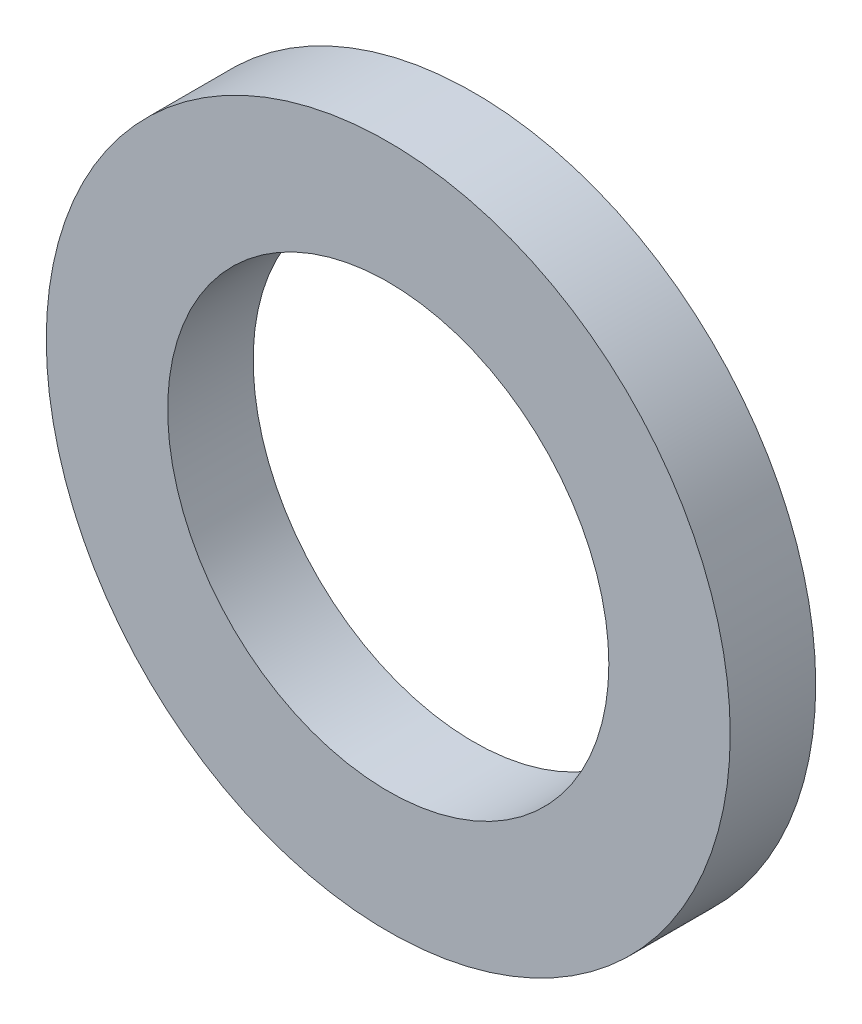
ISO-10303-21;
HEADER;
FILE_DESCRIPTION(('STEP AP214'),'2;1');
FILE_NAME('part.step','',(''),(''),'','','');
FILE_SCHEMA(('AUTOMOTIVE_DESIGN { 1 0 10303 214 1 1 1 1 }'));
ENDSEC;
DATA;
#1=APPLICATION_CONTEXT('core data for automotive mechanical design processes');
#2=APPLICATION_PROTOCOL_DEFINITION('international standard','automotive_design',2000,#1);
#3=PRODUCT_CONTEXT('',#1,'mechanical');
#4=PRODUCT('Part','Part','',(#3));
#5=PRODUCT_RELATED_PRODUCT_CATEGORY('part','',(#4));
#6=PRODUCT_DEFINITION_FORMATION('','',#4);
#7=PRODUCT_DEFINITION_CONTEXT('part definition',#1,'design');
#8=PRODUCT_DEFINITION('design','',#6,#7);
#9=PRODUCT_DEFINITION_SHAPE('','',#8);
#10=(LENGTH_UNIT() NAMED_UNIT(*) SI_UNIT(.MILLI.,.METRE.));
#11=(NAMED_UNIT(*) PLANE_ANGLE_UNIT() SI_UNIT($,.RADIAN.));
#12=(NAMED_UNIT(*) SI_UNIT($,.STERADIAN.) SOLID_ANGLE_UNIT());
#13=UNCERTAINTY_MEASURE_WITH_UNIT(LENGTH_MEASURE(1.E-05),#10,'distance_accuracy_value','');
#14=(GEOMETRIC_REPRESENTATION_CONTEXT(3) GLOBAL_UNCERTAINTY_ASSIGNED_CONTEXT((#13)) GLOBAL_UNIT_ASSIGNED_CONTEXT((#10,
#11,#12)) REPRESENTATION_CONTEXT('',''));
#15=CARTESIAN_POINT('',(0.,0.,0.));
#16=DIRECTION('',(0.,0.,1.));
#17=DIRECTION('',(1.,0.,0.));
#18=AXIS2_PLACEMENT_3D('',#15,#16,#17);
#19=CARTESIAN_POINT('',(0.,0.,0.79375));
#20=DIRECTION('',(0.,0.,1.));
#21=DIRECTION('',(1.,0.,0.));
#22=AXIS2_PLACEMENT_3D('',#19,#20,#21);
#23=PLANE('',#22);
#24=CARTESIAN_POINT('',(0.,0.,0.79375));
#25=DIRECTION('',(0.,0.,1.));
#26=DIRECTION('',(1.,0.,0.));
#27=AXIS2_PLACEMENT_3D('',#24,#25,#26);
#28=CIRCLE('',#27,6.35);
#29=CARTESIAN_POINT('',(6.35,0.,0.79375));
#30=VERTEX_POINT('',#29);
#31=EDGE_CURVE('E10',#30,#30,#28,.T.);
#32=ORIENTED_EDGE('',*,*,#31,.T.);
#33=EDGE_LOOP('',(#32));
#34=FACE_BOUND('',#33,.T.);
#35=CARTESIAN_POINT('',(0.,0.,0.79375));
#36=DIRECTION('',(0.,0.,1.));
#37=DIRECTION('',(1.,0.,0.));
#38=AXIS2_PLACEMENT_3D('',#35,#36,#37);
#39=CIRCLE('',#38,4.09575);
#40=CARTESIAN_POINT('',(4.09575,0.,0.79375));
#41=VERTEX_POINT('',#40);
#42=EDGE_CURVE('E43',#41,#41,#39,.T.);
#43=ORIENTED_EDGE('',*,*,#42,.F.);
#44=EDGE_LOOP('',(#43));
#45=FACE_BOUND('',#44,.T.);
#46=ADVANCED_FACE('F32',(#34,#45),#23,.T.);
#47=CARTESIAN_POINT('',(0.,0.,-0.79375));
#48=DIRECTION('',(0.,0.,1.));
#49=DIRECTION('',(1.,0.,0.));
#50=AXIS2_PLACEMENT_3D('',#47,#48,#49);
#51=PLANE('',#50);
#52=CARTESIAN_POINT('',(0.,0.,-0.79375));
#53=DIRECTION('',(0.,0.,1.));
#54=DIRECTION('',(1.,0.,0.));
#55=AXIS2_PLACEMENT_3D('',#52,#53,#54);
#56=CIRCLE('',#55,6.35);
#57=CARTESIAN_POINT('',(6.35,0.,-0.79375));
#58=VERTEX_POINT('',#57);
#59=EDGE_CURVE('E36',#58,#58,#56,.T.);
#60=ORIENTED_EDGE('',*,*,#59,.F.);
#61=EDGE_LOOP('',(#60));
#62=FACE_BOUND('',#61,.T.);
#63=CARTESIAN_POINT('',(0.,0.,-0.79375));
#64=DIRECTION('',(0.,0.,1.));
#65=DIRECTION('',(1.,0.,0.));
#66=AXIS2_PLACEMENT_3D('',#63,#64,#65);
#67=CIRCLE('',#66,4.09575);
#68=CARTESIAN_POINT('',(4.09575,0.,-0.79375));
#69=VERTEX_POINT('',#68);
#70=EDGE_CURVE('E45',#69,#69,#67,.T.);
#71=ORIENTED_EDGE('',*,*,#70,.T.);
#72=EDGE_LOOP('',(#71));
#73=FACE_BOUND('',#72,.T.);
#74=ADVANCED_FACE('F55',(#62,#73),#51,.F.);
#75=CARTESIAN_POINT('',(0.,0.,0.79375));
#76=DIRECTION('',(0.,0.,-1.));
#77=DIRECTION('',(-1.,0.,0.));
#78=AXIS2_PLACEMENT_3D('',#75,#76,#77);
#79=CYLINDRICAL_SURFACE('',#78,6.35);
#80=ORIENTED_EDGE('',*,*,#31,.F.);
#81=EDGE_LOOP('',(#80));
#82=FACE_BOUND('',#81,.T.);
#83=ORIENTED_EDGE('',*,*,#59,.T.);
#84=EDGE_LOOP('',(#83));
#85=FACE_BOUND('',#84,.T.);
#86=ADVANCED_FACE('F34',(#82,#85),#79,.T.);
#87=CARTESIAN_POINT('',(0.,0.,0.79375));
#88=DIRECTION('',(0.,0.,-1.));
#89=DIRECTION('',(-1.,0.,0.));
#90=AXIS2_PLACEMENT_3D('',#87,#88,#89);
#91=CYLINDRICAL_SURFACE('',#90,4.09575);
#92=ORIENTED_EDGE('',*,*,#42,.T.);
#93=EDGE_LOOP('',(#92));
#94=FACE_BOUND('',#93,.T.);
#95=ORIENTED_EDGE('',*,*,#70,.F.);
#96=EDGE_LOOP('',(#95));
#97=FACE_BOUND('',#96,.T.);
#98=ADVANCED_FACE('F51',(#94,#97),#91,.F.);
#99=CLOSED_SHELL('',(#46,#74,#86,#98));
#100=MANIFOLD_SOLID_BREP('B2',#99);
#101=ADVANCED_BREP_SHAPE_REPRESENTATION('',(#18,#100),#14);
#102=SHAPE_DEFINITION_REPRESENTATION(#9,#101);
ENDSEC;
END-ISO-10303-21;
